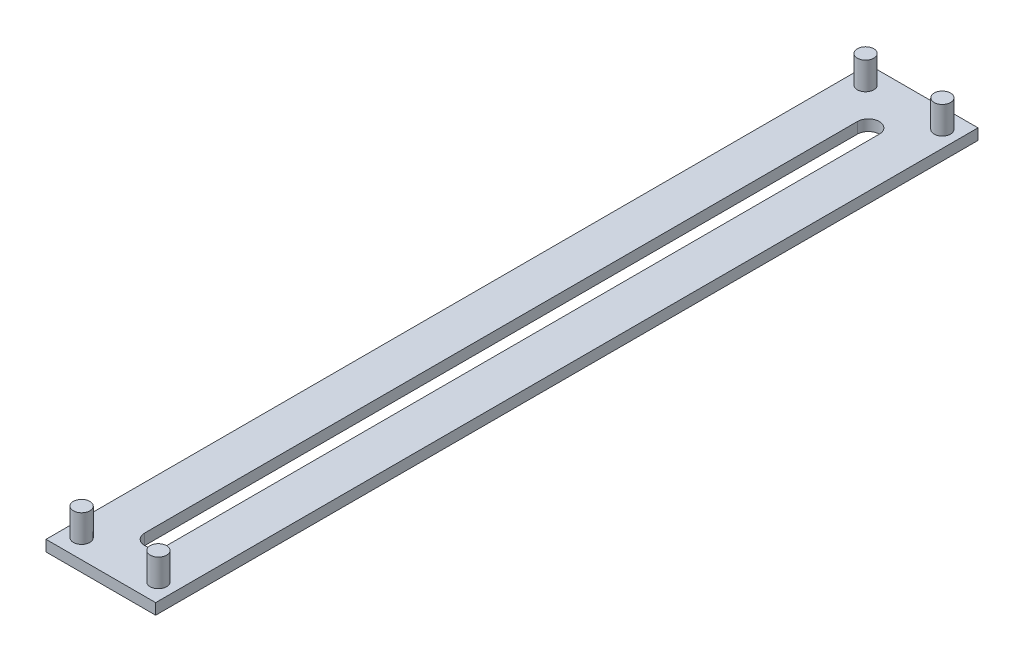
ISO-10303-21;
HEADER;
FILE_DESCRIPTION(('STEP AP214'),'2;1');
FILE_NAME('part.step','',(''),(''),'','','');
FILE_SCHEMA(('AUTOMOTIVE_DESIGN { 1 0 10303 214 1 1 1 1 }'));
ENDSEC;
DATA;
#1=APPLICATION_CONTEXT('core data for automotive mechanical design processes');
#2=APPLICATION_PROTOCOL_DEFINITION('international standard','automotive_design',2000,#1);
#3=PRODUCT_CONTEXT('',#1,'mechanical');
#4=PRODUCT('Part','Part','',(#3));
#5=PRODUCT_RELATED_PRODUCT_CATEGORY('part','',(#4));
#6=PRODUCT_DEFINITION_FORMATION('','',#4);
#7=PRODUCT_DEFINITION_CONTEXT('part definition',#1,'design');
#8=PRODUCT_DEFINITION('design','',#6,#7);
#9=PRODUCT_DEFINITION_SHAPE('','',#8);
#10=(LENGTH_UNIT() NAMED_UNIT(*) SI_UNIT(.MILLI.,.METRE.));
#11=(NAMED_UNIT(*) PLANE_ANGLE_UNIT() SI_UNIT($,.RADIAN.));
#12=(NAMED_UNIT(*) SI_UNIT($,.STERADIAN.) SOLID_ANGLE_UNIT());
#13=UNCERTAINTY_MEASURE_WITH_UNIT(LENGTH_MEASURE(1.E-05),#10,'distance_accuracy_value','');
#14=(GEOMETRIC_REPRESENTATION_CONTEXT(3) GLOBAL_UNCERTAINTY_ASSIGNED_CONTEXT((#13)) GLOBAL_UNIT_ASSIGNED_CONTEXT((#10,
#11,#12)) REPRESENTATION_CONTEXT('',''));
#15=CARTESIAN_POINT('',(0.,0.,0.));
#16=DIRECTION('',(0.,0.,1.));
#17=DIRECTION('',(1.,0.,0.));
#18=AXIS2_PLACEMENT_3D('',#15,#16,#17);
#19=CARTESIAN_POINT('',(0.,2.,0.));
#20=DIRECTION('',(0.,1.,0.));
#21=DIRECTION('',(0.,0.,1.));
#22=AXIS2_PLACEMENT_3D('',#19,#20,#21);
#23=PLANE('',#22);
#24=CARTESIAN_POINT('',(0.,2.,65.));
#25=DIRECTION('',(0.,1.,0.));
#26=DIRECTION('',(0.,0.,1.));
#27=AXIS2_PLACEMENT_3D('',#24,#25,#26);
#28=CIRCLE('',#27,2.00000000000003);
#29=CARTESIAN_POINT('',(-2.00000000000003,2.,65.));
#30=VERTEX_POINT('',#29);
#31=CARTESIAN_POINT('',(2.00000000000003,2.,65.));
#32=VERTEX_POINT('',#31);
#33=EDGE_CURVE('E31',#30,#32,#28,.T.);
#34=ORIENTED_EDGE('',*,*,#33,.F.);
#35=DIRECTION('',(0.,0.,1.));
#36=VECTOR('',#35,1.);
#37=CARTESIAN_POINT('',(-2.00000000000003,2.,65.));
#38=LINE('',#37,#36);
#39=CARTESIAN_POINT('',(-2.00000000000005,2.,-65.));
#40=VERTEX_POINT('',#39);
#41=EDGE_CURVE('E99',#40,#30,#38,.T.);
#42=ORIENTED_EDGE('',*,*,#41,.F.);
#43=CARTESIAN_POINT('',(0.,2.,-65.));
#44=DIRECTION('',(0.,1.,0.));
#45=DIRECTION('',(0.,0.,1.));
#46=AXIS2_PLACEMENT_3D('',#43,#44,#45);
#47=CIRCLE('',#46,2.00000000000003);
#48=CARTESIAN_POINT('',(2.,2.,-65.));
#49=VERTEX_POINT('',#48);
#50=EDGE_CURVE('E102',#49,#40,#47,.T.);
#51=ORIENTED_EDGE('',*,*,#50,.F.);
#52=DIRECTION('',(0.,0.,-1.));
#53=VECTOR('',#52,1.);
#54=CARTESIAN_POINT('',(2.00000000000003,2.,65.));
#55=LINE('',#54,#53);
#56=EDGE_CURVE('E108',#32,#49,#55,.T.);
#57=ORIENTED_EDGE('',*,*,#56,.F.);
#58=EDGE_LOOP('',(#34,#42,#51,#57));
#59=FACE_BOUND('',#58,.T.);
#60=CARTESIAN_POINT('',(-7.,2.,71.5));
#61=DIRECTION('',(0.,1.,0.));
#62=DIRECTION('',(0.,0.,1.));
#63=AXIS2_PLACEMENT_3D('',#60,#61,#62);
#64=CIRCLE('',#63,1.5);
#65=CARTESIAN_POINT('',(-7.,2.,73.));
#66=VERTEX_POINT('',#65);
#67=EDGE_CURVE('E121',#66,#66,#64,.T.);
#68=ORIENTED_EDGE('',*,*,#67,.F.);
#69=EDGE_LOOP('',(#68));
#70=FACE_BOUND('',#69,.T.);
#71=CARTESIAN_POINT('',(-7.,2.,-71.5));
#72=DIRECTION('',(0.,1.,0.));
#73=DIRECTION('',(0.,0.,1.));
#74=AXIS2_PLACEMENT_3D('',#71,#72,#73);
#75=CIRCLE('',#74,1.5);
#76=CARTESIAN_POINT('',(-7.,2.,-70.));
#77=VERTEX_POINT('',#76);
#78=EDGE_CURVE('E133',#77,#77,#75,.T.);
#79=ORIENTED_EDGE('',*,*,#78,.F.);
#80=EDGE_LOOP('',(#79));
#81=FACE_BOUND('',#80,.T.);
#82=DIRECTION('',(0.,0.,1.));
#83=VECTOR('',#82,1.);
#84=CARTESIAN_POINT('',(-10.,2.,75.));
#85=LINE('',#84,#83);
#86=CARTESIAN_POINT('',(-10.,2.,-75.));
#87=VERTEX_POINT('',#86);
#88=CARTESIAN_POINT('',(-10.,2.,75.));
#89=VERTEX_POINT('',#88);
#90=EDGE_CURVE('E142',#87,#89,#85,.T.);
#91=ORIENTED_EDGE('',*,*,#90,.T.);
#92=DIRECTION('',(1.,0.,0.));
#93=VECTOR('',#92,1.);
#94=CARTESIAN_POINT('',(10.,2.,75.));
#95=LINE('',#94,#93);
#96=CARTESIAN_POINT('',(10.,2.,75.));
#97=VERTEX_POINT('',#96);
#98=EDGE_CURVE('E145',#89,#97,#95,.T.);
#99=ORIENTED_EDGE('',*,*,#98,.T.);
#100=DIRECTION('',(0.,0.,-1.));
#101=VECTOR('',#100,1.);
#102=CARTESIAN_POINT('',(10.,2.,75.));
#103=LINE('',#102,#101);
#104=CARTESIAN_POINT('',(10.,2.,-75.));
#105=VERTEX_POINT('',#104);
#106=EDGE_CURVE('E148',#97,#105,#103,.T.);
#107=ORIENTED_EDGE('',*,*,#106,.T.);
#108=DIRECTION('',(-1.,0.,0.));
#109=VECTOR('',#108,1.);
#110=CARTESIAN_POINT('',(10.,2.,-75.));
#111=LINE('',#110,#109);
#112=EDGE_CURVE('E150',#105,#87,#111,.T.);
#113=ORIENTED_EDGE('',*,*,#112,.T.);
#114=EDGE_LOOP('',(#91,#99,#107,#113));
#115=FACE_BOUND('',#114,.T.);
#116=CARTESIAN_POINT('',(7.,2.,-71.5));
#117=DIRECTION('',(0.,1.,0.));
#118=DIRECTION('',(0.,0.,1.));
#119=AXIS2_PLACEMENT_3D('',#116,#117,#118);
#120=CIRCLE('',#119,1.5);
#121=CARTESIAN_POINT('',(7.,2.,-70.));
#122=VERTEX_POINT('',#121);
#123=EDGE_CURVE('E127',#122,#122,#120,.T.);
#124=ORIENTED_EDGE('',*,*,#123,.F.);
#125=EDGE_LOOP('',(#124));
#126=FACE_BOUND('',#125,.T.);
#127=CARTESIAN_POINT('',(7.,2.,71.5));
#128=DIRECTION('',(0.,1.,0.));
#129=DIRECTION('',(0.,0.,1.));
#130=AXIS2_PLACEMENT_3D('',#127,#128,#129);
#131=CIRCLE('',#130,1.5);
#132=CARTESIAN_POINT('',(7.,2.,73.));
#133=VERTEX_POINT('',#132);
#134=EDGE_CURVE('E114',#133,#133,#131,.T.);
#135=ORIENTED_EDGE('',*,*,#134,.F.);
#136=EDGE_LOOP('',(#135));
#137=FACE_BOUND('',#136,.T.);
#138=ADVANCED_FACE('F16',(#59,#70,#81,#115,#126,#137),#23,.T.);
#139=CARTESIAN_POINT('',(-10.,2.,75.));
#140=DIRECTION('',(1.,0.,0.));
#141=DIRECTION('',(0.,0.,-1.));
#142=AXIS2_PLACEMENT_3D('',#139,#140,#141);
#143=PLANE('',#142);
#144=DIRECTION('',(0.,0.,1.));
#145=VECTOR('',#144,1.);
#146=CARTESIAN_POINT('',(-10.,0.,75.));
#147=LINE('',#146,#145);
#148=CARTESIAN_POINT('',(-10.,0.,-75.));
#149=VERTEX_POINT('',#148);
#150=CARTESIAN_POINT('',(-10.,0.,75.));
#151=VERTEX_POINT('',#150);
#152=EDGE_CURVE('E139',#149,#151,#147,.T.);
#153=ORIENTED_EDGE('',*,*,#152,.T.);
#154=DIRECTION('',(0.,-1.,0.));
#155=VECTOR('',#154,1.);
#156=CARTESIAN_POINT('',(-10.,2.,75.));
#157=LINE('',#156,#155);
#158=EDGE_CURVE('E11',#89,#151,#157,.T.);
#159=ORIENTED_EDGE('',*,*,#158,.F.);
#160=ORIENTED_EDGE('',*,*,#90,.F.);
#161=DIRECTION('',(0.,-1.,0.));
#162=VECTOR('',#161,1.);
#163=CARTESIAN_POINT('',(-10.,2.,-75.));
#164=LINE('',#163,#162);
#165=EDGE_CURVE('E152',#87,#149,#164,.T.);
#166=ORIENTED_EDGE('',*,*,#165,.T.);
#167=EDGE_LOOP('',(#153,#159,#160,#166));
#168=FACE_BOUND('',#167,.T.);
#169=ADVANCED_FACE('F18',(#168),#143,.F.);
#170=CARTESIAN_POINT('',(10.,2.,75.));
#171=DIRECTION('',(0.,0.,-1.));
#172=DIRECTION('',(-1.,0.,0.));
#173=AXIS2_PLACEMENT_3D('',#170,#171,#172);
#174=PLANE('',#173);
#175=DIRECTION('',(1.,0.,0.));
#176=VECTOR('',#175,1.);
#177=CARTESIAN_POINT('',(10.,0.,75.));
#178=LINE('',#177,#176);
#179=CARTESIAN_POINT('',(10.,0.,75.));
#180=VERTEX_POINT('',#179);
#181=EDGE_CURVE('E155',#151,#180,#178,.T.);
#182=ORIENTED_EDGE('',*,*,#181,.T.);
#183=DIRECTION('',(0.,-1.,0.));
#184=VECTOR('',#183,1.);
#185=CARTESIAN_POINT('',(10.,2.,75.));
#186=LINE('',#185,#184);
#187=EDGE_CURVE('E24',#97,#180,#186,.T.);
#188=ORIENTED_EDGE('',*,*,#187,.F.);
#189=ORIENTED_EDGE('',*,*,#98,.F.);
#190=ORIENTED_EDGE('',*,*,#158,.T.);
#191=EDGE_LOOP('',(#182,#188,#189,#190));
#192=FACE_BOUND('',#191,.T.);
#193=ADVANCED_FACE('F183',(#192),#174,.F.);
#194=CARTESIAN_POINT('',(10.,2.,75.));
#195=DIRECTION('',(-1.,0.,0.));
#196=DIRECTION('',(0.,0.,1.));
#197=AXIS2_PLACEMENT_3D('',#194,#195,#196);
#198=PLANE('',#197);
#199=DIRECTION('',(0.,0.,-1.));
#200=VECTOR('',#199,1.);
#201=CARTESIAN_POINT('',(10.,0.,75.));
#202=LINE('',#201,#200);
#203=CARTESIAN_POINT('',(10.,0.,-75.));
#204=VERTEX_POINT('',#203);
#205=EDGE_CURVE('E157',#180,#204,#202,.T.);
#206=ORIENTED_EDGE('',*,*,#205,.T.);
#207=DIRECTION('',(0.,-1.,0.));
#208=VECTOR('',#207,1.);
#209=CARTESIAN_POINT('',(10.,2.,-75.));
#210=LINE('',#209,#208);
#211=EDGE_CURVE('E162',#105,#204,#210,.T.);
#212=ORIENTED_EDGE('',*,*,#211,.F.);
#213=ORIENTED_EDGE('',*,*,#106,.F.);
#214=ORIENTED_EDGE('',*,*,#187,.T.);
#215=EDGE_LOOP('',(#206,#212,#213,#214));
#216=FACE_BOUND('',#215,.T.);
#217=ADVANCED_FACE('F169',(#216),#198,.F.);
#218=CARTESIAN_POINT('',(10.,2.,-75.));
#219=DIRECTION('',(0.,0.,1.));
#220=DIRECTION('',(1.,0.,0.));
#221=AXIS2_PLACEMENT_3D('',#218,#219,#220);
#222=PLANE('',#221);
#223=DIRECTION('',(-1.,0.,0.));
#224=VECTOR('',#223,1.);
#225=CARTESIAN_POINT('',(10.,0.,-75.));
#226=LINE('',#225,#224);
#227=EDGE_CURVE('E146',#204,#149,#226,.T.);
#228=ORIENTED_EDGE('',*,*,#227,.T.);
#229=ORIENTED_EDGE('',*,*,#165,.F.);
#230=ORIENTED_EDGE('',*,*,#112,.F.);
#231=ORIENTED_EDGE('',*,*,#211,.T.);
#232=EDGE_LOOP('',(#228,#229,#230,#231));
#233=FACE_BOUND('',#232,.T.);
#234=ADVANCED_FACE('F176',(#233),#222,.F.);
#235=CARTESIAN_POINT('',(0.,0.,0.));
#236=DIRECTION('',(0.,1.,0.));
#237=DIRECTION('',(0.,0.,1.));
#238=AXIS2_PLACEMENT_3D('',#235,#236,#237);
#239=PLANE('',#238);
#240=DIRECTION('',(0.,0.,1.));
#241=VECTOR('',#240,1.);
#242=CARTESIAN_POINT('',(-2.00000000000003,0.,65.));
#243=LINE('',#242,#241);
#244=CARTESIAN_POINT('',(-2.00000000000005,0.,-65.));
#245=VERTEX_POINT('',#244);
#246=CARTESIAN_POINT('',(-2.00000000000003,0.,65.));
#247=VERTEX_POINT('',#246);
#248=EDGE_CURVE('E89',#245,#247,#243,.T.);
#249=ORIENTED_EDGE('',*,*,#248,.T.);
#250=CARTESIAN_POINT('',(0.,0.,65.));
#251=DIRECTION('',(0.,1.,0.));
#252=DIRECTION('',(0.,0.,1.));
#253=AXIS2_PLACEMENT_3D('',#250,#251,#252);
#254=CIRCLE('',#253,2.00000000000003);
#255=CARTESIAN_POINT('',(2.00000000000003,0.,65.));
#256=VERTEX_POINT('',#255);
#257=EDGE_CURVE('E83',#247,#256,#254,.T.);
#258=ORIENTED_EDGE('',*,*,#257,.T.);
#259=DIRECTION('',(0.,0.,-1.));
#260=VECTOR('',#259,1.);
#261=CARTESIAN_POINT('',(2.00000000000003,0.,65.));
#262=LINE('',#261,#260);
#263=CARTESIAN_POINT('',(2.,0.,-65.));
#264=VERTEX_POINT('',#263);
#265=EDGE_CURVE('E92',#256,#264,#262,.T.);
#266=ORIENTED_EDGE('',*,*,#265,.T.);
#267=CARTESIAN_POINT('',(0.,0.,-65.));
#268=DIRECTION('',(0.,1.,0.));
#269=DIRECTION('',(0.,0.,1.));
#270=AXIS2_PLACEMENT_3D('',#267,#268,#269);
#271=CIRCLE('',#270,2.00000000000003);
#272=EDGE_CURVE('E39',#264,#245,#271,.T.);
#273=ORIENTED_EDGE('',*,*,#272,.T.);
#274=EDGE_LOOP('',(#249,#258,#266,#273));
#275=FACE_BOUND('',#274,.T.);
#276=ORIENTED_EDGE('',*,*,#152,.F.);
#277=ORIENTED_EDGE('',*,*,#227,.F.);
#278=ORIENTED_EDGE('',*,*,#205,.F.);
#279=ORIENTED_EDGE('',*,*,#181,.F.);
#280=EDGE_LOOP('',(#276,#277,#278,#279));
#281=FACE_BOUND('',#280,.T.);
#282=ADVANCED_FACE('F96',(#275,#281),#239,.F.);
#283=CARTESIAN_POINT('',(-7.,7.,-71.5));
#284=DIRECTION('',(0.,-1.,0.));
#285=DIRECTION('',(0.,0.,-1.));
#286=AXIS2_PLACEMENT_3D('',#283,#284,#285);
#287=CYLINDRICAL_SURFACE('',#286,1.5);
#288=CARTESIAN_POINT('',(-7.,7.,-71.5));
#289=DIRECTION('',(0.,1.,0.));
#290=DIRECTION('',(0.,0.,1.));
#291=AXIS2_PLACEMENT_3D('',#288,#289,#290);
#292=CIRCLE('',#291,1.5);
#293=CARTESIAN_POINT('',(-7.,7.,-70.));
#294=VERTEX_POINT('',#293);
#295=EDGE_CURVE('E136',#294,#294,#292,.T.);
#296=ORIENTED_EDGE('',*,*,#295,.F.);
#297=EDGE_LOOP('',(#296));
#298=FACE_BOUND('',#297,.T.);
#299=ORIENTED_EDGE('',*,*,#78,.T.);
#300=EDGE_LOOP('',(#299));
#301=FACE_BOUND('',#300,.T.);
#302=ADVANCED_FACE('F201',(#298,#301),#287,.T.);
#303=CARTESIAN_POINT('',(-7.,7.,-71.5));
#304=DIRECTION('',(0.,1.,0.));
#305=DIRECTION('',(0.,0.,1.));
#306=AXIS2_PLACEMENT_3D('',#303,#304,#305);
#307=PLANE('',#306);
#308=ORIENTED_EDGE('',*,*,#295,.T.);
#309=EDGE_LOOP('',(#308));
#310=FACE_BOUND('',#309,.T.);
#311=ADVANCED_FACE('F227',(#310),#307,.T.);
#312=CARTESIAN_POINT('',(7.,7.,-71.5));
#313=DIRECTION('',(0.,-1.,0.));
#314=DIRECTION('',(0.,0.,-1.));
#315=AXIS2_PLACEMENT_3D('',#312,#313,#314);
#316=CYLINDRICAL_SURFACE('',#315,1.5);
#317=CARTESIAN_POINT('',(7.,7.,-71.5));
#318=DIRECTION('',(0.,1.,0.));
#319=DIRECTION('',(0.,0.,1.));
#320=AXIS2_PLACEMENT_3D('',#317,#318,#319);
#321=CIRCLE('',#320,1.5);
#322=CARTESIAN_POINT('',(7.,7.,-70.));
#323=VERTEX_POINT('',#322);
#324=EDGE_CURVE('E130',#323,#323,#321,.T.);
#325=ORIENTED_EDGE('',*,*,#324,.F.);
#326=EDGE_LOOP('',(#325));
#327=FACE_BOUND('',#326,.T.);
#328=ORIENTED_EDGE('',*,*,#123,.T.);
#329=EDGE_LOOP('',(#328));
#330=FACE_BOUND('',#329,.T.);
#331=ADVANCED_FACE('F235',(#327,#330),#316,.T.);
#332=CARTESIAN_POINT('',(7.,7.,-71.5));
#333=DIRECTION('',(0.,1.,0.));
#334=DIRECTION('',(0.,0.,1.));
#335=AXIS2_PLACEMENT_3D('',#332,#333,#334);
#336=PLANE('',#335);
#337=ORIENTED_EDGE('',*,*,#324,.T.);
#338=EDGE_LOOP('',(#337));
#339=FACE_BOUND('',#338,.T.);
#340=ADVANCED_FACE('F243',(#339),#336,.T.);
#341=CARTESIAN_POINT('',(-7.,7.,71.5));
#342=DIRECTION('',(0.,-1.,0.));
#343=DIRECTION('',(0.,0.,-1.));
#344=AXIS2_PLACEMENT_3D('',#341,#342,#343);
#345=CYLINDRICAL_SURFACE('',#344,1.5);
#346=CARTESIAN_POINT('',(-7.,7.,71.5));
#347=DIRECTION('',(0.,1.,0.));
#348=DIRECTION('',(0.,0.,1.));
#349=AXIS2_PLACEMENT_3D('',#346,#347,#348);
#350=CIRCLE('',#349,1.5);
#351=CARTESIAN_POINT('',(-7.,7.,73.));
#352=VERTEX_POINT('',#351);
#353=EDGE_CURVE('E124',#352,#352,#350,.T.);
#354=ORIENTED_EDGE('',*,*,#353,.F.);
#355=EDGE_LOOP('',(#354));
#356=FACE_BOUND('',#355,.T.);
#357=ORIENTED_EDGE('',*,*,#67,.T.);
#358=EDGE_LOOP('',(#357));
#359=FACE_BOUND('',#358,.T.);
#360=ADVANCED_FACE('F252',(#356,#359),#345,.T.);
#361=CARTESIAN_POINT('',(-7.,7.,71.5));
#362=DIRECTION('',(0.,1.,0.));
#363=DIRECTION('',(0.,0.,1.));
#364=AXIS2_PLACEMENT_3D('',#361,#362,#363);
#365=PLANE('',#364);
#366=ORIENTED_EDGE('',*,*,#353,.T.);
#367=EDGE_LOOP('',(#366));
#368=FACE_BOUND('',#367,.T.);
#369=ADVANCED_FACE('F261',(#368),#365,.T.);
#370=CARTESIAN_POINT('',(7.,7.,71.5));
#371=DIRECTION('',(0.,-1.,0.));
#372=DIRECTION('',(0.,0.,-1.));
#373=AXIS2_PLACEMENT_3D('',#370,#371,#372);
#374=CYLINDRICAL_SURFACE('',#373,1.5);
#375=CARTESIAN_POINT('',(7.,7.,71.5));
#376=DIRECTION('',(0.,1.,0.));
#377=DIRECTION('',(0.,0.,1.));
#378=AXIS2_PLACEMENT_3D('',#375,#376,#377);
#379=CIRCLE('',#378,1.5);
#380=CARTESIAN_POINT('',(7.,7.,73.));
#381=VERTEX_POINT('',#380);
#382=EDGE_CURVE('E118',#381,#381,#379,.T.);
#383=ORIENTED_EDGE('',*,*,#382,.F.);
#384=EDGE_LOOP('',(#383));
#385=FACE_BOUND('',#384,.T.);
#386=ORIENTED_EDGE('',*,*,#134,.T.);
#387=EDGE_LOOP('',(#386));
#388=FACE_BOUND('',#387,.T.);
#389=ADVANCED_FACE('F270',(#385,#388),#374,.T.);
#390=CARTESIAN_POINT('',(7.,7.,71.5));
#391=DIRECTION('',(0.,1.,0.));
#392=DIRECTION('',(0.,0.,1.));
#393=AXIS2_PLACEMENT_3D('',#390,#391,#392);
#394=PLANE('',#393);
#395=ORIENTED_EDGE('',*,*,#382,.T.);
#396=EDGE_LOOP('',(#395));
#397=FACE_BOUND('',#396,.T.);
#398=ADVANCED_FACE('F279',(#397),#394,.T.);
#399=CARTESIAN_POINT('',(0.,0.,65.));
#400=DIRECTION('',(0.,1.,0.));
#401=DIRECTION('',(0.,0.,1.));
#402=AXIS2_PLACEMENT_3D('',#399,#400,#401);
#403=CYLINDRICAL_SURFACE('',#402,2.00000000000003);
#404=ORIENTED_EDGE('',*,*,#33,.T.);
#405=DIRECTION('',(0.,1.,0.));
#406=VECTOR('',#405,1.);
#407=CARTESIAN_POINT('',(2.00000000000003,0.,65.));
#408=LINE('',#407,#406);
#409=EDGE_CURVE('E79',#256,#32,#408,.T.);
#410=ORIENTED_EDGE('',*,*,#409,.F.);
#411=ORIENTED_EDGE('',*,*,#257,.F.);
#412=DIRECTION('',(0.,1.,0.));
#413=VECTOR('',#412,1.);
#414=CARTESIAN_POINT('',(-2.00000000000003,0.,65.));
#415=LINE('',#414,#413);
#416=EDGE_CURVE('E112',#247,#30,#415,.T.);
#417=ORIENTED_EDGE('',*,*,#416,.T.);
#418=EDGE_LOOP('',(#404,#410,#411,#417));
#419=FACE_BOUND('',#418,.T.);
#420=ADVANCED_FACE('F81',(#419),#403,.F.);
#421=CARTESIAN_POINT('',(-2.00000000000003,0.,65.));
#422=DIRECTION('',(-1.,0.,0.));
#423=DIRECTION('',(0.,0.,1.));
#424=AXIS2_PLACEMENT_3D('',#421,#422,#423);
#425=PLANE('',#424);
#426=ORIENTED_EDGE('',*,*,#41,.T.);
#427=ORIENTED_EDGE('',*,*,#416,.F.);
#428=ORIENTED_EDGE('',*,*,#248,.F.);
#429=DIRECTION('',(0.,1.,0.));
#430=VECTOR('',#429,1.);
#431=CARTESIAN_POINT('',(-2.00000000000005,0.,-65.));
#432=LINE('',#431,#430);
#433=EDGE_CURVE('E115',#245,#40,#432,.T.);
#434=ORIENTED_EDGE('',*,*,#433,.T.);
#435=EDGE_LOOP('',(#426,#427,#428,#434));
#436=FACE_BOUND('',#435,.T.);
#437=ADVANCED_FACE('F296',(#436),#425,.F.);
#438=CARTESIAN_POINT('',(0.,0.,-65.));
#439=DIRECTION('',(0.,1.,0.));
#440=DIRECTION('',(0.,0.,1.));
#441=AXIS2_PLACEMENT_3D('',#438,#439,#440);
#442=CYLINDRICAL_SURFACE('',#441,2.00000000000003);
#443=ORIENTED_EDGE('',*,*,#50,.T.);
#444=ORIENTED_EDGE('',*,*,#433,.F.);
#445=ORIENTED_EDGE('',*,*,#272,.F.);
#446=DIRECTION('',(0.,1.,0.));
#447=VECTOR('',#446,1.);
#448=CARTESIAN_POINT('',(2.,0.,-65.));
#449=LINE('',#448,#447);
#450=EDGE_CURVE('E88',#264,#49,#449,.T.);
#451=ORIENTED_EDGE('',*,*,#450,.T.);
#452=EDGE_LOOP('',(#443,#444,#445,#451));
#453=FACE_BOUND('',#452,.T.);
#454=ADVANCED_FACE('F304',(#453),#442,.F.);
#455=CARTESIAN_POINT('',(2.00000000000003,0.,65.));
#456=DIRECTION('',(1.,0.,0.));
#457=DIRECTION('',(0.,0.,-1.));
#458=AXIS2_PLACEMENT_3D('',#455,#456,#457);
#459=PLANE('',#458);
#460=ORIENTED_EDGE('',*,*,#56,.T.);
#461=ORIENTED_EDGE('',*,*,#450,.F.);
#462=ORIENTED_EDGE('',*,*,#265,.F.);
#463=ORIENTED_EDGE('',*,*,#409,.T.);
#464=EDGE_LOOP('',(#460,#461,#462,#463));
#465=FACE_BOUND('',#464,.T.);
#466=ADVANCED_FACE('F93',(#465),#459,.F.);
#467=CLOSED_SHELL('',(#138,#169,#193,#217,#234,#282,#302,#311,#331,#340,#360,#369,#389,#398,
#420,#437,#454,#466));
#468=MANIFOLD_SOLID_BREP('B1',#467);
#469=ADVANCED_BREP_SHAPE_REPRESENTATION('',(#18,#468),#14);
#470=SHAPE_DEFINITION_REPRESENTATION(#9,#469);
ENDSEC;
END-ISO-10303-21;
